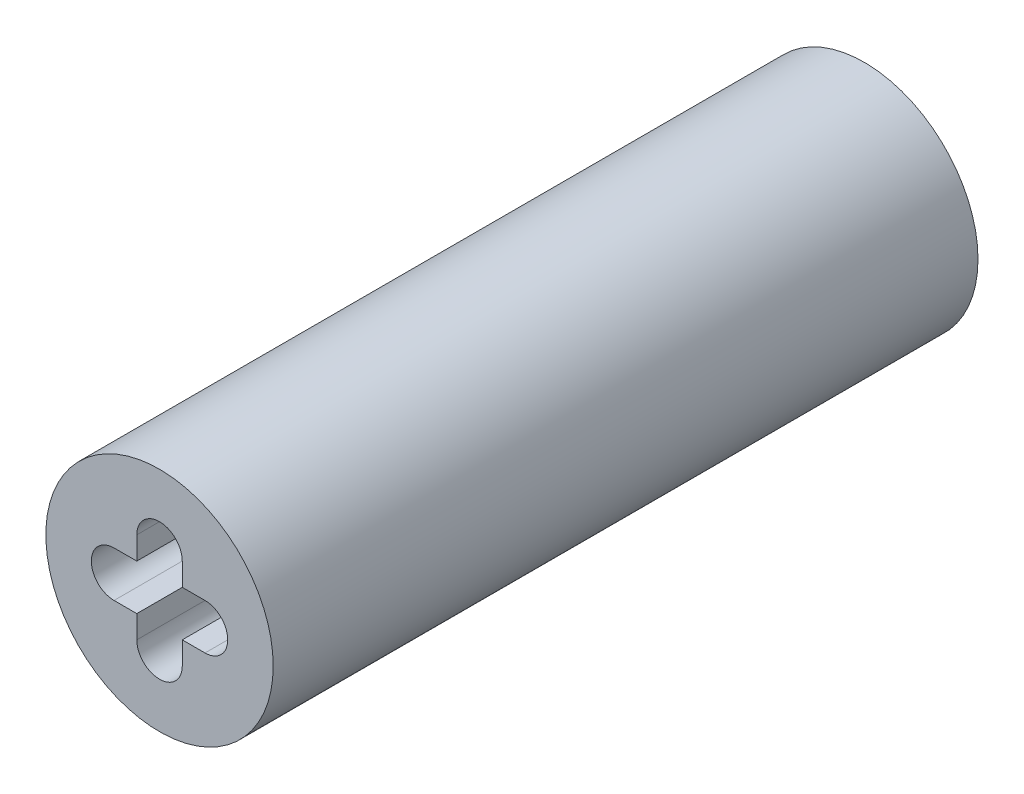
ISO-10303-21;
HEADER;
FILE_DESCRIPTION(('STEP AP214'),'2;1');
FILE_NAME('part.step','',(''),(''),'','','');
FILE_SCHEMA(('AUTOMOTIVE_DESIGN { 1 0 10303 214 1 1 1 1 }'));
ENDSEC;
DATA;
#1=APPLICATION_CONTEXT('core data for automotive mechanical design processes');
#2=APPLICATION_PROTOCOL_DEFINITION('international standard','automotive_design',2000,#1);
#3=PRODUCT_CONTEXT('',#1,'mechanical');
#4=PRODUCT('Part','Part','',(#3));
#5=PRODUCT_RELATED_PRODUCT_CATEGORY('part','',(#4));
#6=PRODUCT_DEFINITION_FORMATION('','',#4);
#7=PRODUCT_DEFINITION_CONTEXT('part definition',#1,'design');
#8=PRODUCT_DEFINITION('design','',#6,#7);
#9=PRODUCT_DEFINITION_SHAPE('','',#8);
#10=(LENGTH_UNIT() NAMED_UNIT(*) SI_UNIT(.MILLI.,.METRE.));
#11=(NAMED_UNIT(*) PLANE_ANGLE_UNIT() SI_UNIT($,.RADIAN.));
#12=(NAMED_UNIT(*) SI_UNIT($,.STERADIAN.) SOLID_ANGLE_UNIT());
#13=UNCERTAINTY_MEASURE_WITH_UNIT(LENGTH_MEASURE(1.E-05),#10,'distance_accuracy_value','');
#14=(GEOMETRIC_REPRESENTATION_CONTEXT(3) GLOBAL_UNCERTAINTY_ASSIGNED_CONTEXT((#13)) GLOBAL_UNIT_ASSIGNED_CONTEXT((#10,
#11,#12)) REPRESENTATION_CONTEXT('',''));
#15=CARTESIAN_POINT('',(0.,0.,0.));
#16=DIRECTION('',(0.,0.,1.));
#17=DIRECTION('',(1.,0.,0.));
#18=AXIS2_PLACEMENT_3D('',#15,#16,#17);
#19=CARTESIAN_POINT('',(1.524,-1.524,23.622));
#20=DIRECTION('',(0.,0.,-1.));
#21=DIRECTION('',(-1.,0.,0.));
#22=AXIS2_PLACEMENT_3D('',#19,#20,#21);
#23=CYLINDRICAL_SURFACE('',#22,0.761999999999999);
#24=CARTESIAN_POINT('',(1.524,-1.524,0.));
#25=DIRECTION('',(0.,0.,1.));
#26=DIRECTION('',(1.,0.,0.));
#27=AXIS2_PLACEMENT_3D('',#24,#25,#26);
#28=CIRCLE('',#27,0.761999999999999);
#29=CARTESIAN_POINT('',(0.762000000000001,-1.524,0.));
#30=VERTEX_POINT('',#29);
#31=CARTESIAN_POINT('',(2.286,-1.524,0.));
#32=VERTEX_POINT('',#31);
#33=EDGE_CURVE('E184',#30,#32,#28,.T.);
#34=ORIENTED_EDGE('',*,*,#33,.F.);
#35=DIRECTION('',(0.,0.,-1.));
#36=VECTOR('',#35,1.);
#37=CARTESIAN_POINT('',(0.762000000000001,-1.524,23.622));
#38=LINE('',#37,#36);
#39=CARTESIAN_POINT('',(0.762000000000001,-1.524,23.622));
#40=VERTEX_POINT('',#39);
#41=EDGE_CURVE('E11',#40,#30,#38,.T.);
#42=ORIENTED_EDGE('',*,*,#41,.F.);
#43=CARTESIAN_POINT('',(1.524,-1.524,23.622));
#44=DIRECTION('',(0.,0.,1.));
#45=DIRECTION('',(1.,0.,0.));
#46=AXIS2_PLACEMENT_3D('',#43,#44,#45);
#47=CIRCLE('',#46,0.761999999999999);
#48=CARTESIAN_POINT('',(2.286,-1.524,23.622));
#49=VERTEX_POINT('',#48);
#50=EDGE_CURVE('E162',#40,#49,#47,.T.);
#51=ORIENTED_EDGE('',*,*,#50,.T.);
#52=DIRECTION('',(0.,0.,-1.));
#53=VECTOR('',#52,1.);
#54=CARTESIAN_POINT('',(2.286,-1.524,23.622));
#55=LINE('',#54,#53);
#56=EDGE_CURVE('E96',#49,#32,#55,.T.);
#57=ORIENTED_EDGE('',*,*,#56,.T.);
#58=EDGE_LOOP('',(#34,#42,#51,#57));
#59=FACE_BOUND('',#58,.T.);
#60=ADVANCED_FACE('F34',(#59),#23,.F.);
#61=CARTESIAN_POINT('',(0.762000000000001,-8.52342135623731,23.622));
#62=DIRECTION('',(1.,0.,0.));
#63=DIRECTION('',(0.,0.,-1.));
#64=AXIS2_PLACEMENT_3D('',#61,#62,#63);
#65=PLANE('',#64);
#66=DIRECTION('',(0.,-1.,0.));
#67=VECTOR('',#66,1.);
#68=CARTESIAN_POINT('',(0.762000000000001,-8.52342135623731,0.));
#69=LINE('',#68,#67);
#70=CARTESIAN_POINT('',(0.762000000000001,-0.762,0.));
#71=VERTEX_POINT('',#70);
#72=EDGE_CURVE('E187',#71,#30,#69,.T.);
#73=ORIENTED_EDGE('',*,*,#72,.F.);
#74=DIRECTION('',(0.,0.,-1.));
#75=VECTOR('',#74,1.);
#76=CARTESIAN_POINT('',(0.762000000000001,-0.762,23.622));
#77=LINE('',#76,#75);
#78=CARTESIAN_POINT('',(0.762000000000001,-0.762,23.622));
#79=VERTEX_POINT('',#78);
#80=EDGE_CURVE('E42',#79,#71,#77,.T.);
#81=ORIENTED_EDGE('',*,*,#80,.F.);
#82=DIRECTION('',(0.,-1.,0.));
#83=VECTOR('',#82,1.);
#84=CARTESIAN_POINT('',(0.762000000000001,-8.52342135623731,23.622));
#85=LINE('',#84,#83);
#86=EDGE_CURVE('E156',#79,#40,#85,.T.);
#87=ORIENTED_EDGE('',*,*,#86,.T.);
#88=ORIENTED_EDGE('',*,*,#41,.T.);
#89=EDGE_LOOP('',(#73,#81,#87,#88));
#90=FACE_BOUND('',#89,.T.);
#91=ADVANCED_FACE('F229',(#90),#65,.T.);
#92=CARTESIAN_POINT('',(1.524,-0.762,23.622));
#93=DIRECTION('',(0.,1.,0.));
#94=DIRECTION('',(0.,0.,1.));
#95=AXIS2_PLACEMENT_3D('',#92,#93,#94);
#96=PLANE('',#95);
#97=DIRECTION('',(1.,0.,0.));
#98=VECTOR('',#97,1.);
#99=CARTESIAN_POINT('',(1.524,-0.762,0.));
#100=LINE('',#99,#98);
#101=CARTESIAN_POINT('',(0.,-0.762,0.));
#102=VERTEX_POINT('',#101);
#103=EDGE_CURVE('E190',#102,#71,#100,.T.);
#104=ORIENTED_EDGE('',*,*,#103,.F.);
#105=DIRECTION('',(0.,0.,-1.));
#106=VECTOR('',#105,1.);
#107=CARTESIAN_POINT('',(0.,-0.762,23.622));
#108=LINE('',#107,#106);
#109=CARTESIAN_POINT('',(0.,-0.762,23.622));
#110=VERTEX_POINT('',#109);
#111=EDGE_CURVE('E225',#110,#102,#108,.T.);
#112=ORIENTED_EDGE('',*,*,#111,.F.);
#113=DIRECTION('',(1.,0.,0.));
#114=VECTOR('',#113,1.);
#115=CARTESIAN_POINT('',(1.524,-0.762,23.622));
#116=LINE('',#115,#114);
#117=EDGE_CURVE('E148',#110,#79,#116,.T.);
#118=ORIENTED_EDGE('',*,*,#117,.T.);
#119=ORIENTED_EDGE('',*,*,#80,.T.);
#120=EDGE_LOOP('',(#104,#112,#118,#119));
#121=FACE_BOUND('',#120,.T.);
#122=ADVANCED_FACE('F228',(#121),#96,.T.);
#123=CARTESIAN_POINT('',(0.,0.,23.622));
#124=DIRECTION('',(0.,0.,-1.));
#125=DIRECTION('',(-1.,0.,0.));
#126=AXIS2_PLACEMENT_3D('',#123,#124,#125);
#127=CYLINDRICAL_SURFACE('',#126,0.762);
#128=CARTESIAN_POINT('',(0.,0.,0.));
#129=DIRECTION('',(0.,0.,1.));
#130=DIRECTION('',(1.,0.,0.));
#131=AXIS2_PLACEMENT_3D('',#128,#129,#130);
#132=CIRCLE('',#131,0.762);
#133=CARTESIAN_POINT('',(0.,0.762000000000001,0.));
#134=VERTEX_POINT('',#133);
#135=EDGE_CURVE('E194',#134,#102,#132,.T.);
#136=ORIENTED_EDGE('',*,*,#135,.F.);
#137=DIRECTION('',(0.,0.,-1.));
#138=VECTOR('',#137,1.);
#139=CARTESIAN_POINT('',(0.,0.762000000000001,23.622));
#140=LINE('',#139,#138);
#141=CARTESIAN_POINT('',(0.,0.762000000000001,23.622));
#142=VERTEX_POINT('',#141);
#143=EDGE_CURVE('E223',#142,#134,#140,.T.);
#144=ORIENTED_EDGE('',*,*,#143,.F.);
#145=CARTESIAN_POINT('',(0.,0.,23.622));
#146=DIRECTION('',(0.,0.,1.));
#147=DIRECTION('',(1.,0.,0.));
#148=AXIS2_PLACEMENT_3D('',#145,#146,#147);
#149=CIRCLE('',#148,0.762);
#150=EDGE_CURVE('E155',#142,#110,#149,.T.);
#151=ORIENTED_EDGE('',*,*,#150,.T.);
#152=ORIENTED_EDGE('',*,*,#111,.T.);
#153=EDGE_LOOP('',(#136,#144,#151,#152));
#154=FACE_BOUND('',#153,.T.);
#155=ADVANCED_FACE('F237',(#154),#127,.F.);
#156=CARTESIAN_POINT('',(1.524,0.762000000000001,23.622));
#157=DIRECTION('',(0.,1.,0.));
#158=DIRECTION('',(0.,0.,1.));
#159=AXIS2_PLACEMENT_3D('',#156,#157,#158);
#160=PLANE('',#159);
#161=DIRECTION('',(1.,0.,0.));
#162=VECTOR('',#161,1.);
#163=CARTESIAN_POINT('',(1.524,0.762000000000001,0.));
#164=LINE('',#163,#162);
#165=CARTESIAN_POINT('',(0.762000000000001,0.762000000000001,0.));
#166=VERTEX_POINT('',#165);
#167=EDGE_CURVE('E198',#134,#166,#164,.T.);
#168=ORIENTED_EDGE('',*,*,#167,.T.);
#169=DIRECTION('',(0.,0.,-1.));
#170=VECTOR('',#169,1.);
#171=CARTESIAN_POINT('',(0.762000000000001,0.762000000000001,23.622));
#172=LINE('',#171,#170);
#173=CARTESIAN_POINT('',(0.762000000000001,0.762000000000001,23.622));
#174=VERTEX_POINT('',#173);
#175=EDGE_CURVE('E221',#174,#166,#172,.T.);
#176=ORIENTED_EDGE('',*,*,#175,.F.);
#177=DIRECTION('',(1.,0.,0.));
#178=VECTOR('',#177,1.);
#179=CARTESIAN_POINT('',(1.524,0.762000000000001,23.622));
#180=LINE('',#179,#178);
#181=EDGE_CURVE('E160',#142,#174,#180,.T.);
#182=ORIENTED_EDGE('',*,*,#181,.F.);
#183=ORIENTED_EDGE('',*,*,#143,.T.);
#184=EDGE_LOOP('',(#168,#176,#182,#183));
#185=FACE_BOUND('',#184,.T.);
#186=ADVANCED_FACE('F251',(#185),#160,.F.);
#187=CARTESIAN_POINT('',(0.762000000000001,1.524,0.));
#188=VERTEX_POINT('',#187);
#189=EDGE_CURVE('E191',#188,#166,#69,.T.);
#190=ORIENTED_EDGE('',*,*,#189,.F.);
#191=DIRECTION('',(0.,0.,-1.));
#192=VECTOR('',#191,1.);
#193=CARTESIAN_POINT('',(0.762000000000001,1.524,23.622));
#194=LINE('',#193,#192);
#195=CARTESIAN_POINT('',(0.762000000000001,1.524,23.622));
#196=VERTEX_POINT('',#195);
#197=EDGE_CURVE('E219',#196,#188,#194,.T.);
#198=ORIENTED_EDGE('',*,*,#197,.F.);
#199=EDGE_CURVE('E163',#196,#174,#85,.T.);
#200=ORIENTED_EDGE('',*,*,#199,.T.);
#201=ORIENTED_EDGE('',*,*,#175,.T.);
#202=EDGE_LOOP('',(#190,#198,#200,#201));
#203=FACE_BOUND('',#202,.T.);
#204=ADVANCED_FACE('F243',(#203),#65,.T.);
#205=CARTESIAN_POINT('',(1.524,1.524,23.622));
#206=DIRECTION('',(0.,0.,-1.));
#207=DIRECTION('',(-1.,0.,0.));
#208=AXIS2_PLACEMENT_3D('',#205,#206,#207);
#209=CYLINDRICAL_SURFACE('',#208,0.761999999999999);
#210=CARTESIAN_POINT('',(1.524,1.524,0.));
#211=DIRECTION('',(0.,0.,1.));
#212=DIRECTION('',(1.,0.,0.));
#213=AXIS2_PLACEMENT_3D('',#210,#211,#212);
#214=CIRCLE('',#213,0.761999999999999);
#215=CARTESIAN_POINT('',(2.286,1.524,0.));
#216=VERTEX_POINT('',#215);
#217=EDGE_CURVE('E202',#216,#188,#214,.T.);
#218=ORIENTED_EDGE('',*,*,#217,.F.);
#219=DIRECTION('',(0.,0.,-1.));
#220=VECTOR('',#219,1.);
#221=CARTESIAN_POINT('',(2.286,1.524,23.622));
#222=LINE('',#221,#220);
#223=CARTESIAN_POINT('',(2.286,1.524,23.622));
#224=VERTEX_POINT('',#223);
#225=EDGE_CURVE('E217',#224,#216,#222,.T.);
#226=ORIENTED_EDGE('',*,*,#225,.F.);
#227=CARTESIAN_POINT('',(1.524,1.524,23.622));
#228=DIRECTION('',(0.,0.,1.));
#229=DIRECTION('',(1.,0.,0.));
#230=AXIS2_PLACEMENT_3D('',#227,#228,#229);
#231=CIRCLE('',#230,0.761999999999999);
#232=EDGE_CURVE('E169',#224,#196,#231,.T.);
#233=ORIENTED_EDGE('',*,*,#232,.T.);
#234=ORIENTED_EDGE('',*,*,#197,.T.);
#235=EDGE_LOOP('',(#218,#226,#233,#234));
#236=FACE_BOUND('',#235,.T.);
#237=ADVANCED_FACE('F250',(#236),#209,.F.);
#238=CARTESIAN_POINT('',(2.286,-8.52342135623731,23.622));
#239=DIRECTION('',(1.,0.,0.));
#240=DIRECTION('',(0.,0.,-1.));
#241=AXIS2_PLACEMENT_3D('',#238,#239,#240);
#242=PLANE('',#241);
#243=DIRECTION('',(0.,-1.,0.));
#244=VECTOR('',#243,1.);
#245=CARTESIAN_POINT('',(2.286,-8.52342135623731,0.));
#246=LINE('',#245,#244);
#247=CARTESIAN_POINT('',(2.286,0.762000000000001,0.));
#248=VERTEX_POINT('',#247);
#249=EDGE_CURVE('E205',#216,#248,#246,.T.);
#250=ORIENTED_EDGE('',*,*,#249,.T.);
#251=DIRECTION('',(0.,0.,-1.));
#252=VECTOR('',#251,1.);
#253=CARTESIAN_POINT('',(2.286,0.762000000000001,23.622));
#254=LINE('',#253,#252);
#255=CARTESIAN_POINT('',(2.286,0.762000000000001,23.622));
#256=VERTEX_POINT('',#255);
#257=EDGE_CURVE('E214',#256,#248,#254,.T.);
#258=ORIENTED_EDGE('',*,*,#257,.F.);
#259=DIRECTION('',(0.,-1.,0.));
#260=VECTOR('',#259,1.);
#261=CARTESIAN_POINT('',(2.286,-8.52342135623731,23.622));
#262=LINE('',#261,#260);
#263=EDGE_CURVE('E151',#224,#256,#262,.T.);
#264=ORIENTED_EDGE('',*,*,#263,.F.);
#265=ORIENTED_EDGE('',*,*,#225,.T.);
#266=EDGE_LOOP('',(#250,#258,#264,#265));
#267=FACE_BOUND('',#266,.T.);
#268=ADVANCED_FACE('F256',(#267),#242,.F.);
#269=CARTESIAN_POINT('',(3.048,0.762000000000001,0.));
#270=VERTEX_POINT('',#269);
#271=EDGE_CURVE('E201',#248,#270,#164,.T.);
#272=ORIENTED_EDGE('',*,*,#271,.T.);
#273=DIRECTION('',(0.,0.,-1.));
#274=VECTOR('',#273,1.);
#275=CARTESIAN_POINT('',(3.048,0.762000000000001,23.622));
#276=LINE('',#275,#274);
#277=CARTESIAN_POINT('',(3.048,0.762000000000001,23.622));
#278=VERTEX_POINT('',#277);
#279=EDGE_CURVE('E137',#278,#270,#276,.T.);
#280=ORIENTED_EDGE('',*,*,#279,.F.);
#281=EDGE_CURVE('E143',#256,#278,#180,.T.);
#282=ORIENTED_EDGE('',*,*,#281,.F.);
#283=ORIENTED_EDGE('',*,*,#257,.T.);
#284=EDGE_LOOP('',(#272,#280,#282,#283));
#285=FACE_BOUND('',#284,.T.);
#286=ADVANCED_FACE('F260',(#285),#160,.F.);
#287=CARTESIAN_POINT('',(3.048,0.,23.622));
#288=DIRECTION('',(0.,0.,-1.));
#289=DIRECTION('',(-1.,0.,0.));
#290=AXIS2_PLACEMENT_3D('',#287,#288,#289);
#291=CYLINDRICAL_SURFACE('',#290,0.762);
#292=CARTESIAN_POINT('',(3.048,0.,0.));
#293=DIRECTION('',(0.,0.,1.));
#294=DIRECTION('',(1.,0.,0.));
#295=AXIS2_PLACEMENT_3D('',#292,#293,#294);
#296=CIRCLE('',#295,0.762);
#297=CARTESIAN_POINT('',(3.048,-0.762,0.));
#298=VERTEX_POINT('',#297);
#299=EDGE_CURVE('E132',#298,#270,#296,.T.);
#300=ORIENTED_EDGE('',*,*,#299,.F.);
#301=DIRECTION('',(0.,0.,-1.));
#302=VECTOR('',#301,1.);
#303=CARTESIAN_POINT('',(3.048,-0.762,23.622));
#304=LINE('',#303,#302);
#305=CARTESIAN_POINT('',(3.048,-0.762,23.622));
#306=VERTEX_POINT('',#305);
#307=EDGE_CURVE('E127',#306,#298,#304,.T.);
#308=ORIENTED_EDGE('',*,*,#307,.F.);
#309=CARTESIAN_POINT('',(3.048,0.,23.622));
#310=DIRECTION('',(0.,0.,1.));
#311=DIRECTION('',(1.,0.,0.));
#312=AXIS2_PLACEMENT_3D('',#309,#310,#311);
#313=CIRCLE('',#312,0.762);
#314=EDGE_CURVE('E130',#306,#278,#313,.T.);
#315=ORIENTED_EDGE('',*,*,#314,.T.);
#316=ORIENTED_EDGE('',*,*,#279,.T.);
#317=EDGE_LOOP('',(#300,#308,#315,#316));
#318=FACE_BOUND('',#317,.T.);
#319=ADVANCED_FACE('F129',(#318),#291,.F.);
#320=CARTESIAN_POINT('',(2.286,-0.762,0.));
#321=VERTEX_POINT('',#320);
#322=EDGE_CURVE('E195',#321,#298,#100,.T.);
#323=ORIENTED_EDGE('',*,*,#322,.F.);
#324=DIRECTION('',(0.,0.,-1.));
#325=VECTOR('',#324,1.);
#326=CARTESIAN_POINT('',(2.286,-0.762,23.622));
#327=LINE('',#326,#325);
#328=CARTESIAN_POINT('',(2.286,-0.762,23.622));
#329=VERTEX_POINT('',#328);
#330=EDGE_CURVE('E89',#329,#321,#327,.T.);
#331=ORIENTED_EDGE('',*,*,#330,.F.);
#332=EDGE_CURVE('E141',#329,#306,#116,.T.);
#333=ORIENTED_EDGE('',*,*,#332,.T.);
#334=ORIENTED_EDGE('',*,*,#307,.T.);
#335=EDGE_LOOP('',(#323,#331,#333,#334));
#336=FACE_BOUND('',#335,.T.);
#337=ADVANCED_FACE('F146',(#336),#96,.T.);
#338=EDGE_CURVE('E207',#321,#32,#246,.T.);
#339=ORIENTED_EDGE('',*,*,#338,.T.);
#340=ORIENTED_EDGE('',*,*,#56,.F.);
#341=EDGE_CURVE('E50',#329,#49,#262,.T.);
#342=ORIENTED_EDGE('',*,*,#341,.F.);
#343=ORIENTED_EDGE('',*,*,#330,.T.);
#344=EDGE_LOOP('',(#339,#340,#342,#343));
#345=FACE_BOUND('',#344,.T.);
#346=ADVANCED_FACE('F268',(#345),#242,.F.);
#347=CARTESIAN_POINT('',(1.524,0.,23.622));
#348=DIRECTION('',(0.,0.,-1.));
#349=DIRECTION('',(-1.,0.,0.));
#350=AXIS2_PLACEMENT_3D('',#347,#348,#349);
#351=CYLINDRICAL_SURFACE('',#350,3.81);
#352=CARTESIAN_POINT('',(1.524,0.,23.622));
#353=DIRECTION('',(0.,0.,1.));
#354=DIRECTION('',(1.,0.,0.));
#355=AXIS2_PLACEMENT_3D('',#352,#353,#354);
#356=CIRCLE('',#355,3.81);
#357=CARTESIAN_POINT('',(5.334,0.,23.622));
#358=VERTEX_POINT('',#357);
#359=EDGE_CURVE('E149',#358,#358,#356,.T.);
#360=ORIENTED_EDGE('',*,*,#359,.F.);
#361=EDGE_LOOP('',(#360));
#362=FACE_BOUND('',#361,.T.);
#363=CARTESIAN_POINT('',(1.524,0.,0.));
#364=DIRECTION('',(0.,0.,1.));
#365=DIRECTION('',(1.,0.,0.));
#366=AXIS2_PLACEMENT_3D('',#363,#364,#365);
#367=CIRCLE('',#366,3.81);
#368=CARTESIAN_POINT('',(5.334,0.,0.));
#369=VERTEX_POINT('',#368);
#370=EDGE_CURVE('E166',#369,#369,#367,.T.);
#371=ORIENTED_EDGE('',*,*,#370,.T.);
#372=EDGE_LOOP('',(#371));
#373=FACE_BOUND('',#372,.T.);
#374=ADVANCED_FACE('F270',(#362,#373),#351,.T.);
#375=CARTESIAN_POINT('',(1.524,-8.52342135623731,23.622));
#376=DIRECTION('',(0.,0.,1.));
#377=DIRECTION('',(1.,0.,0.));
#378=AXIS2_PLACEMENT_3D('',#375,#376,#377);
#379=PLANE('',#378);
#380=ORIENTED_EDGE('',*,*,#50,.F.);
#381=ORIENTED_EDGE('',*,*,#86,.F.);
#382=ORIENTED_EDGE('',*,*,#117,.F.);
#383=ORIENTED_EDGE('',*,*,#150,.F.);
#384=ORIENTED_EDGE('',*,*,#181,.T.);
#385=ORIENTED_EDGE('',*,*,#199,.F.);
#386=ORIENTED_EDGE('',*,*,#232,.F.);
#387=ORIENTED_EDGE('',*,*,#263,.T.);
#388=ORIENTED_EDGE('',*,*,#281,.T.);
#389=ORIENTED_EDGE('',*,*,#314,.F.);
#390=ORIENTED_EDGE('',*,*,#332,.F.);
#391=ORIENTED_EDGE('',*,*,#341,.T.);
#392=EDGE_LOOP('',(#380,#381,#382,#383,#384,#385,#386,#387,#388,#389,#390,#391));
#393=FACE_BOUND('',#392,.T.);
#394=ORIENTED_EDGE('',*,*,#359,.T.);
#395=EDGE_LOOP('',(#394));
#396=FACE_BOUND('',#395,.T.);
#397=ADVANCED_FACE('F139',(#393,#396),#379,.T.);
#398=CARTESIAN_POINT('',(1.524,-8.52342135623731,0.));
#399=DIRECTION('',(0.,0.,1.));
#400=DIRECTION('',(1.,0.,0.));
#401=AXIS2_PLACEMENT_3D('',#398,#399,#400);
#402=PLANE('',#401);
#403=ORIENTED_EDGE('',*,*,#33,.T.);
#404=ORIENTED_EDGE('',*,*,#338,.F.);
#405=ORIENTED_EDGE('',*,*,#322,.T.);
#406=ORIENTED_EDGE('',*,*,#299,.T.);
#407=ORIENTED_EDGE('',*,*,#271,.F.);
#408=ORIENTED_EDGE('',*,*,#249,.F.);
#409=ORIENTED_EDGE('',*,*,#217,.T.);
#410=ORIENTED_EDGE('',*,*,#189,.T.);
#411=ORIENTED_EDGE('',*,*,#167,.F.);
#412=ORIENTED_EDGE('',*,*,#135,.T.);
#413=ORIENTED_EDGE('',*,*,#103,.T.);
#414=ORIENTED_EDGE('',*,*,#72,.T.);
#415=EDGE_LOOP('',(#403,#404,#405,#406,#407,#408,#409,#410,#411,#412,#413,#414));
#416=FACE_BOUND('',#415,.T.);
#417=ORIENTED_EDGE('',*,*,#370,.F.);
#418=EDGE_LOOP('',(#417));
#419=FACE_BOUND('',#418,.T.);
#420=ADVANCED_FACE('F231',(#416,#419),#402,.F.);
#421=CLOSED_SHELL('',(#60,#91,#122,#155,#186,#204,#237,#268,#286,#319,#337,#346,#374,#397,#420));
#422=MANIFOLD_SOLID_BREP('B2',#421);
#423=ADVANCED_BREP_SHAPE_REPRESENTATION('',(#18,#422),#14);
#424=SHAPE_DEFINITION_REPRESENTATION(#9,#423);
ENDSEC;
END-ISO-10303-21;
